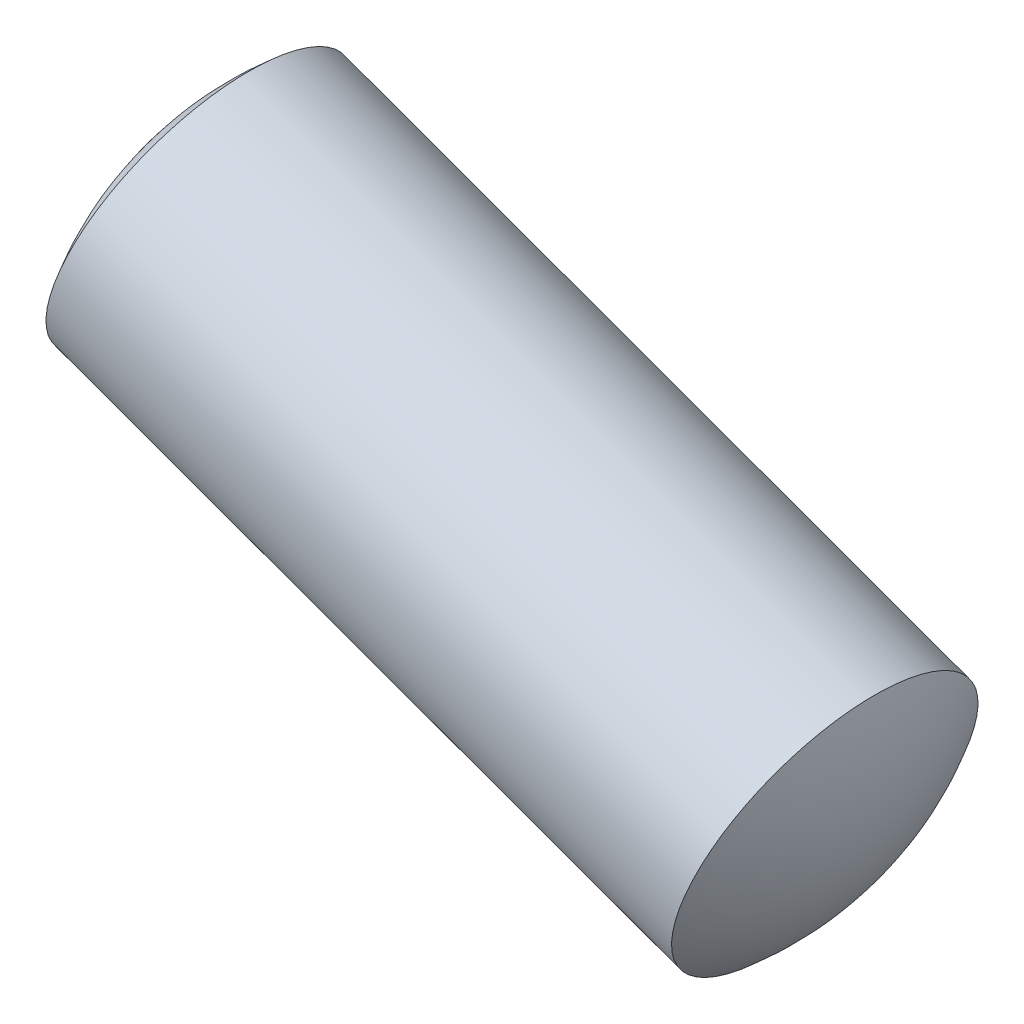
ISO-10303-21;
HEADER;
FILE_DESCRIPTION(('STEP AP214'),'2;1');
FILE_NAME('part.step','',(''),(''),'','','');
FILE_SCHEMA(('AUTOMOTIVE_DESIGN { 1 0 10303 214 1 1 1 1 }'));
ENDSEC;
DATA;
#1=APPLICATION_CONTEXT('core data for automotive mechanical design processes');
#2=APPLICATION_PROTOCOL_DEFINITION('international standard','automotive_design',2000,#1);
#3=PRODUCT_CONTEXT('',#1,'mechanical');
#4=PRODUCT('Part','Part','',(#3));
#5=PRODUCT_RELATED_PRODUCT_CATEGORY('part','',(#4));
#6=PRODUCT_DEFINITION_FORMATION('','',#4);
#7=PRODUCT_DEFINITION_CONTEXT('part definition',#1,'design');
#8=PRODUCT_DEFINITION('design','',#6,#7);
#9=PRODUCT_DEFINITION_SHAPE('','',#8);
#10=(LENGTH_UNIT() NAMED_UNIT(*) SI_UNIT(.MILLI.,.METRE.));
#11=(NAMED_UNIT(*) PLANE_ANGLE_UNIT() SI_UNIT($,.RADIAN.));
#12=(NAMED_UNIT(*) SI_UNIT($,.STERADIAN.) SOLID_ANGLE_UNIT());
#13=UNCERTAINTY_MEASURE_WITH_UNIT(LENGTH_MEASURE(1.E-05),#10,'distance_accuracy_value','');
#14=(GEOMETRIC_REPRESENTATION_CONTEXT(3) GLOBAL_UNCERTAINTY_ASSIGNED_CONTEXT((#13)) GLOBAL_UNIT_ASSIGNED_CONTEXT((#10,
#11,#12)) REPRESENTATION_CONTEXT('',''));
#15=CARTESIAN_POINT('',(0.,0.,0.));
#16=DIRECTION('',(0.,0.,1.));
#17=DIRECTION('',(1.,0.,0.));
#18=AXIS2_PLACEMENT_3D('',#15,#16,#17);
#19=CARTESIAN_POINT('',(-20.9683275595858,7.62869195982696,0.6));
#20=DIRECTION('',(0.34189527767198,0.93973805877255,0.));
#21=DIRECTION('',(-0.93973805877255,0.341895277671978,0.));
#22=AXIS2_PLACEMENT_3D('',#19,#20,#21);
#23=SPHERICAL_SURFACE('',#22,2.);
#24=CARTESIAN_POINT('',(-20.9683275595858,7.62869195982696,0.6));
#25=DIRECTION('',(0.93973805877255,-0.341895277671979,0.));
#26=DIRECTION('',(0.,0.,-1.));
#27=AXIS2_PLACEMENT_3D('',#24,#25,#26);
#28=SPHERICAL_SURFACE('',#27,2.);
#29=CARTESIAN_POINT('',(-22.5960016231859,8.22087195162269,0.6));
#30=DIRECTION('',(0.93973805877255,-0.34189527767198,0.));
#31=DIRECTION('',(0.,0.,-1.));
#32=AXIS2_PLACEMENT_3D('',#29,#30,#31);
#33=CIRCLE('',#32,1.);
#34=CARTESIAN_POINT('',(-22.5960016231859,8.22087195162269,-0.4));
#35=VERTEX_POINT('',#34);
#36=EDGE_CURVE('E11',#35,#35,#33,.T.);
#37=ORIENTED_EDGE('',*,*,#36,.F.);
#38=EDGE_LOOP('',(#37));
#39=FACE_BOUND('',#38,.T.);
#40=ADVANCED_FACE('F17',(#39),#28,.T.);
#41=CARTESIAN_POINT('',(-19.9102779970202,7.24375261890409,0.6));
#42=DIRECTION('',(0.34189527767198,0.93973805877255,0.));
#43=DIRECTION('',(0.93973805877255,-0.341895277671978,0.));
#44=AXIS2_PLACEMENT_3D('',#41,#42,#43);
#45=SPHERICAL_SURFACE('',#44,2.);
#46=CARTESIAN_POINT('',(-19.9102779970202,7.24375261890409,0.6));
#47=DIRECTION('',(0.93973805877255,-0.341895277671979,0.));
#48=DIRECTION('',(0.,0.,-1.));
#49=AXIS2_PLACEMENT_3D('',#46,#47,#48);
#50=SPHERICAL_SURFACE('',#49,2.);
#51=CARTESIAN_POINT('',(-18.28260393342,6.65157262710836,0.6));
#52=DIRECTION('',(0.93973805877255,-0.34189527767198,0.));
#53=DIRECTION('',(0.,0.,-1.));
#54=AXIS2_PLACEMENT_3D('',#51,#52,#53);
#55=CIRCLE('',#54,1.);
#56=CARTESIAN_POINT('',(-18.28260393342,6.65157262710836,-0.4));
#57=VERTEX_POINT('',#56);
#58=EDGE_CURVE('E27',#57,#57,#55,.T.);
#59=ORIENTED_EDGE('',*,*,#58,.T.);
#60=EDGE_LOOP('',(#59));
#61=FACE_BOUND('',#60,.T.);
#62=ADVANCED_FACE('F40',(#61),#50,.T.);
#63=CARTESIAN_POINT('',(-19.3609533558615,7.04389745823697,0.6));
#64=DIRECTION('',(0.93973805877255,-0.34189527767198,0.));
#65=DIRECTION('',(0.,0.,-1.));
#66=AXIS2_PLACEMENT_3D('',#63,#64,#65);
#67=CYLINDRICAL_SURFACE('',#66,1.);
#68=ORIENTED_EDGE('',*,*,#36,.T.);
#69=EDGE_LOOP('',(#68));
#70=FACE_BOUND('',#69,.T.);
#71=ORIENTED_EDGE('',*,*,#58,.F.);
#72=EDGE_LOOP('',(#71));
#73=FACE_BOUND('',#72,.T.);
#74=ADVANCED_FACE('F19',(#70,#73),#67,.T.);
#75=CLOSED_SHELL('',(#40,#62,#74));
#76=MANIFOLD_SOLID_BREP('B1',#75);
#77=ADVANCED_BREP_SHAPE_REPRESENTATION('',(#18,#76),#14);
#78=SHAPE_DEFINITION_REPRESENTATION(#9,#77);
ENDSEC;
END-ISO-10303-21;
